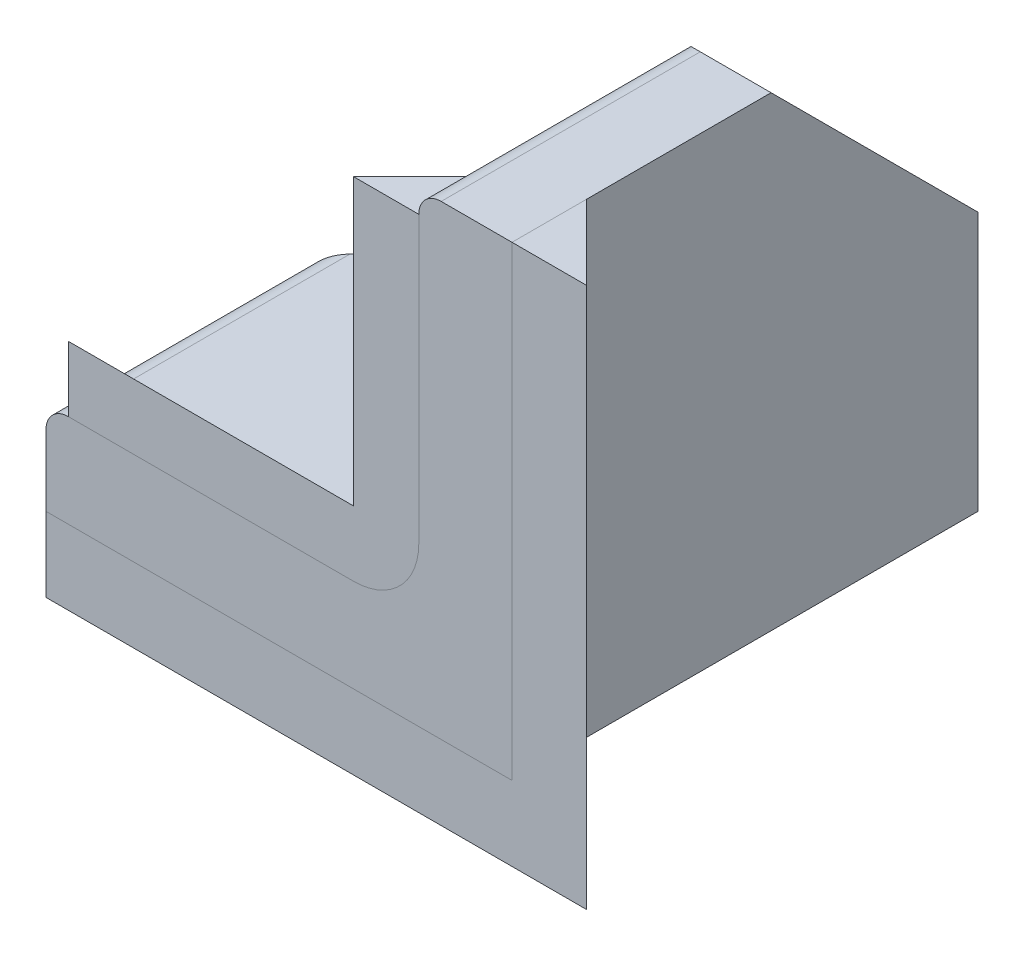
ISO-10303-21;
HEADER;
FILE_DESCRIPTION(('STEP AP214'),'2;1');
FILE_NAME('part.step','',(''),(''),'','','');
FILE_SCHEMA(('AUTOMOTIVE_DESIGN { 1 0 10303 214 1 1 1 1 }'));
ENDSEC;
DATA;
#1=APPLICATION_CONTEXT('core data for automotive mechanical design processes');
#2=APPLICATION_PROTOCOL_DEFINITION('international standard','automotive_design',2000,#1);
#3=PRODUCT_CONTEXT('',#1,'mechanical');
#4=PRODUCT('Part','Part','',(#3));
#5=PRODUCT_RELATED_PRODUCT_CATEGORY('part','',(#4));
#6=PRODUCT_DEFINITION_FORMATION('','',#4);
#7=PRODUCT_DEFINITION_CONTEXT('part definition',#1,'design');
#8=PRODUCT_DEFINITION('design','',#6,#7);
#9=PRODUCT_DEFINITION_SHAPE('','',#8);
#10=(LENGTH_UNIT() NAMED_UNIT(*) SI_UNIT(.MILLI.,.METRE.));
#11=(NAMED_UNIT(*) PLANE_ANGLE_UNIT() SI_UNIT($,.RADIAN.));
#12=(NAMED_UNIT(*) SI_UNIT($,.STERADIAN.) SOLID_ANGLE_UNIT());
#13=UNCERTAINTY_MEASURE_WITH_UNIT(LENGTH_MEASURE(1.E-05),#10,'distance_accuracy_value','');
#14=(GEOMETRIC_REPRESENTATION_CONTEXT(3) GLOBAL_UNCERTAINTY_ASSIGNED_CONTEXT((#13)) GLOBAL_UNIT_ASSIGNED_CONTEXT((#10,
#11,#12)) REPRESENTATION_CONTEXT('',''));
#15=CARTESIAN_POINT('',(0.,0.,0.));
#16=DIRECTION('',(0.,0.,1.));
#17=DIRECTION('',(1.,0.,0.));
#18=AXIS2_PLACEMENT_3D('',#15,#16,#17);
#19=CARTESIAN_POINT('',(0.,0.,-4.));
#20=DIRECTION('',(0.,-1.,0.));
#21=DIRECTION('',(1.,0.,0.));
#22=AXIS2_PLACEMENT_3D('',#19,#20,#21);
#23=PLANE('',#22);
#24=DIRECTION('',(0.,0.,-1.));
#25=VECTOR('',#24,1.);
#26=CARTESIAN_POINT('',(-25.,0.,-4.));
#27=LINE('',#26,#25);
#28=CARTESIAN_POINT('',(-25.,0.,0.));
#29=VERTEX_POINT('',#28);
#30=CARTESIAN_POINT('',(-25.,0.,-4.));
#31=VERTEX_POINT('',#30);
#32=EDGE_CURVE('E56',#29,#31,#27,.T.);
#33=ORIENTED_EDGE('',*,*,#32,.F.);
#34=DIRECTION('',(-1.,0.,0.));
#35=VECTOR('',#34,1.);
#36=CARTESIAN_POINT('',(0.,0.,0.));
#37=LINE('',#36,#35);
#38=CARTESIAN_POINT('',(0.,0.,0.));
#39=VERTEX_POINT('',#38);
#40=EDGE_CURVE('E121',#39,#29,#37,.T.);
#41=ORIENTED_EDGE('',*,*,#40,.F.);
#42=DIRECTION('',(0.,0.,1.));
#43=VECTOR('',#42,1.);
#44=CARTESIAN_POINT('',(0.,0.,-4.));
#45=LINE('',#44,#43);
#46=CARTESIAN_POINT('',(0.,0.,-4.));
#47=VERTEX_POINT('',#46);
#48=EDGE_CURVE('E113',#47,#39,#45,.T.);
#49=ORIENTED_EDGE('',*,*,#48,.F.);
#50=DIRECTION('',(-1.,0.,0.));
#51=VECTOR('',#50,1.);
#52=CARTESIAN_POINT('',(0.,0.,-4.));
#53=LINE('',#52,#51);
#54=EDGE_CURVE('E126',#47,#31,#53,.T.);
#55=ORIENTED_EDGE('',*,*,#54,.T.);
#56=EDGE_LOOP('',(#33,#41,#49,#55));
#57=FACE_BOUND('',#56,.T.);
#58=ADVANCED_FACE('F48',(#57),#23,.F.);
#59=CARTESIAN_POINT('',(5.21895141649746,-5.21895141649746,1.21895141649746));
#60=DIRECTION('',(0.,0.707106781186547,0.707106781186547));
#61=DIRECTION('',(0.,-0.707106781186548,0.707106781186548));
#62=AXIS2_PLACEMENT_3D('',#59,#60,#61);
#63=PLANE('',#62);
#64=DIRECTION('',(0.,-0.707106781186548,0.707106781186548));
#65=VECTOR('',#64,1.);
#66=CARTESIAN_POINT('',(-25.,-5.21895141649746,1.21895141649746));
#67=LINE('',#66,#65);
#68=CARTESIAN_POINT('',(-25.,-4.,0.));
#69=VERTEX_POINT('',#68);
#70=EDGE_CURVE('E13',#31,#69,#67,.T.);
#71=ORIENTED_EDGE('',*,*,#70,.F.);
#72=ORIENTED_EDGE('',*,*,#54,.F.);
#73=DIRECTION('',(-0.577350269189626,0.577350269189626,-0.577350269189626));
#74=VECTOR('',#73,1.);
#75=CARTESIAN_POINT('',(5.21895141649746,-5.21895141649746,1.21895141649746));
#76=LINE('',#75,#74);
#77=CARTESIAN_POINT('',(4.,-4.,0.));
#78=VERTEX_POINT('',#77);
#79=EDGE_CURVE('E97',#78,#47,#76,.T.);
#80=ORIENTED_EDGE('',*,*,#79,.F.);
#81=DIRECTION('',(-1.,0.,0.));
#82=VECTOR('',#81,1.);
#83=CARTESIAN_POINT('',(4.,-4.,0.));
#84=LINE('',#83,#82);
#85=EDGE_CURVE('E124',#78,#69,#84,.T.);
#86=ORIENTED_EDGE('',*,*,#85,.T.);
#87=EDGE_LOOP('',(#71,#72,#80,#86));
#88=FACE_BOUND('',#87,.T.);
#89=ADVANCED_FACE('F50',(#88),#63,.F.);
#90=CARTESIAN_POINT('',(0.,25.,-4.));
#91=DIRECTION('',(0.,1.,0.));
#92=DIRECTION('',(0.,0.,1.));
#93=AXIS2_PLACEMENT_3D('',#90,#91,#92);
#94=PLANE('',#93);
#95=DIRECTION('',(-0.707106781186548,0.,-0.707106781186548));
#96=VECTOR('',#95,1.);
#97=CARTESIAN_POINT('',(4.,25.,0.));
#98=LINE('',#97,#96);
#99=CARTESIAN_POINT('',(4.,25.,0.));
#100=VERTEX_POINT('',#99);
#101=CARTESIAN_POINT('',(0.,25.,-4.));
#102=VERTEX_POINT('',#101);
#103=EDGE_CURVE('E94',#100,#102,#98,.T.);
#104=ORIENTED_EDGE('',*,*,#103,.T.);
#105=DIRECTION('',(0.,0.,1.));
#106=VECTOR('',#105,1.);
#107=CARTESIAN_POINT('',(0.,25.,-4.));
#108=LINE('',#107,#106);
#109=CARTESIAN_POINT('',(0.,25.,0.));
#110=VERTEX_POINT('',#109);
#111=EDGE_CURVE('E104',#102,#110,#108,.T.);
#112=ORIENTED_EDGE('',*,*,#111,.T.);
#113=DIRECTION('',(1.,0.,0.));
#114=VECTOR('',#113,1.);
#115=CARTESIAN_POINT('',(0.,25.,0.));
#116=LINE('',#115,#114);
#117=EDGE_CURVE('E101',#110,#100,#116,.T.);
#118=ORIENTED_EDGE('',*,*,#117,.T.);
#119=EDGE_LOOP('',(#104,#112,#118));
#120=FACE_BOUND('',#119,.T.);
#121=ADVANCED_FACE('F110',(#120),#94,.T.);
#122=CARTESIAN_POINT('',(4.,-7.65685424949238,0.));
#123=DIRECTION('',(0.707106781186547,0.,-0.707106781186547));
#124=DIRECTION('',(-0.707106781186548,0.,-0.707106781186548));
#125=AXIS2_PLACEMENT_3D('',#122,#123,#124);
#126=PLANE('',#125);
#127=DIRECTION('',(0.,1.,0.));
#128=VECTOR('',#127,1.);
#129=CARTESIAN_POINT('',(4.,-7.65685424949238,0.));
#130=LINE('',#129,#128);
#131=EDGE_CURVE('E117',#78,#100,#130,.T.);
#132=ORIENTED_EDGE('',*,*,#131,.F.);
#133=ORIENTED_EDGE('',*,*,#79,.T.);
#134=DIRECTION('',(0.,1.,0.));
#135=VECTOR('',#134,1.);
#136=CARTESIAN_POINT('',(0.,-7.65685424949238,-4.));
#137=LINE('',#136,#135);
#138=EDGE_CURVE('E89',#47,#102,#137,.T.);
#139=ORIENTED_EDGE('',*,*,#138,.T.);
#140=ORIENTED_EDGE('',*,*,#103,.F.);
#141=EDGE_LOOP('',(#132,#133,#139,#140));
#142=FACE_BOUND('',#141,.T.);
#143=ADVANCED_FACE('F92',(#142),#126,.T.);
#144=CARTESIAN_POINT('',(0.,-7.65685424949238,-4.));
#145=DIRECTION('',(-1.,0.,0.));
#146=DIRECTION('',(0.,0.,1.));
#147=AXIS2_PLACEMENT_3D('',#144,#145,#146);
#148=PLANE('',#147);
#149=ORIENTED_EDGE('',*,*,#138,.F.);
#150=ORIENTED_EDGE('',*,*,#48,.T.);
#151=DIRECTION('',(0.,1.,0.));
#152=VECTOR('',#151,1.);
#153=CARTESIAN_POINT('',(0.,-7.65685424949238,0.));
#154=LINE('',#153,#152);
#155=EDGE_CURVE('E100',#39,#110,#154,.T.);
#156=ORIENTED_EDGE('',*,*,#155,.T.);
#157=ORIENTED_EDGE('',*,*,#111,.F.);
#158=EDGE_LOOP('',(#149,#150,#156,#157));
#159=FACE_BOUND('',#158,.T.);
#160=ADVANCED_FACE('F105',(#159),#148,.T.);
#161=CARTESIAN_POINT('',(0.,-7.65685424949238,0.));
#162=DIRECTION('',(0.,0.,1.));
#163=DIRECTION('',(1.,0.,0.));
#164=AXIS2_PLACEMENT_3D('',#161,#162,#163);
#165=PLANE('',#164);
#166=ORIENTED_EDGE('',*,*,#155,.F.);
#167=ORIENTED_EDGE('',*,*,#40,.T.);
#168=DIRECTION('',(0.,1.,0.));
#169=VECTOR('',#168,1.);
#170=CARTESIAN_POINT('',(-25.,-3.82842712474619,0.));
#171=LINE('',#170,#169);
#172=EDGE_CURVE('E64',#69,#29,#171,.T.);
#173=ORIENTED_EDGE('',*,*,#172,.F.);
#174=ORIENTED_EDGE('',*,*,#85,.F.);
#175=ORIENTED_EDGE('',*,*,#131,.T.);
#176=ORIENTED_EDGE('',*,*,#117,.F.);
#177=EDGE_LOOP('',(#166,#167,#173,#174,#175,#176));
#178=FACE_BOUND('',#177,.T.);
#179=ADVANCED_FACE('F133',(#178),#165,.T.);
#180=CARTESIAN_POINT('',(-25.,-2.,-2.));
#181=DIRECTION('',(-1.,0.,0.));
#182=DIRECTION('',(0.,-1.,0.));
#183=AXIS2_PLACEMENT_3D('',#180,#181,#182);
#184=PLANE('',#183);
#185=ORIENTED_EDGE('',*,*,#32,.T.);
#186=ORIENTED_EDGE('',*,*,#70,.T.);
#187=ORIENTED_EDGE('',*,*,#172,.T.);
#188=EDGE_LOOP('',(#185,#186,#187));
#189=FACE_BOUND('',#188,.T.);
#190=ADVANCED_FACE('F131',(#189),#184,.T.);
#191=CLOSED_SHELL('',(#58,#89,#121,#143,#160,#179,#190));
#192=MANIFOLD_SOLID_BREP('B2',#191);
#193=CARTESIAN_POINT('',(-8.5,5.,-3.5));
#194=DIRECTION('',(0.,-0.707106781186548,0.707106781186548));
#195=DIRECTION('',(0.,-0.707106781186548,-0.707106781186548));
#196=AXIS2_PLACEMENT_3D('',#193,#194,#195);
#197=PLANE('',#196);
#198=DIRECTION('',(0.,0.707106781186547,0.707106781186547));
#199=VECTOR('',#198,1.);
#200=CARTESIAN_POINT('',(-8.5,5.,-3.5));
#201=LINE('',#200,#199);
#202=CARTESIAN_POINT('',(-8.5,5.,-3.5));
#203=VERTEX_POINT('',#202);
#204=CARTESIAN_POINT('',(-8.5,8.5,0.));
#205=VERTEX_POINT('',#204);
#206=EDGE_CURVE('E264',#203,#205,#201,.T.);
#207=ORIENTED_EDGE('',*,*,#206,.F.);
#208=DIRECTION('',(-1.,0.,0.));
#209=VECTOR('',#208,1.);
#210=CARTESIAN_POINT('',(-8.5,5.,-3.5));
#211=LINE('',#210,#209);
#212=CARTESIAN_POINT('',(-23.8,5.,-3.5));
#213=VERTEX_POINT('',#212);
#214=EDGE_CURVE('E210',#203,#213,#211,.T.);
#215=ORIENTED_EDGE('',*,*,#214,.T.);
#216=DIRECTION('',(0.,0.707106781186547,0.707106781186547));
#217=VECTOR('',#216,1.);
#218=CARTESIAN_POINT('',(-23.8,5.,-3.5));
#219=LINE('',#218,#217);
#220=CARTESIAN_POINT('',(-23.8,8.5,0.));
#221=VERTEX_POINT('',#220);
#222=EDGE_CURVE('E217',#213,#221,#219,.T.);
#223=ORIENTED_EDGE('',*,*,#222,.T.);
#224=DIRECTION('',(-1.,0.,0.));
#225=VECTOR('',#224,1.);
#226=CARTESIAN_POINT('',(-8.5,8.5,0.));
#227=LINE('',#226,#225);
#228=EDGE_CURVE('E46',#205,#221,#227,.T.);
#229=ORIENTED_EDGE('',*,*,#228,.F.);
#230=EDGE_LOOP('',(#207,#215,#223,#229));
#231=FACE_BOUND('',#230,.T.);
#232=ADVANCED_FACE('F203',(#231),#197,.F.);
#233=CARTESIAN_POINT('',(-8.5,5.,0.));
#234=DIRECTION('',(0.,1.,0.));
#235=DIRECTION('',(-1.,0.,0.));
#236=AXIS2_PLACEMENT_3D('',#233,#234,#235);
#237=PLANE('',#236);
#238=DIRECTION('',(0.,0.,-1.));
#239=VECTOR('',#238,1.);
#240=CARTESIAN_POINT('',(-8.5,5.,0.));
#241=LINE('',#240,#239);
#242=CARTESIAN_POINT('',(-8.5,5.,0.));
#243=VERTEX_POINT('',#242);
#244=EDGE_CURVE('E287',#243,#203,#241,.T.);
#245=ORIENTED_EDGE('',*,*,#244,.F.);
#246=DIRECTION('',(-1.,0.,0.));
#247=VECTOR('',#246,1.);
#248=CARTESIAN_POINT('',(-8.5,5.,0.));
#249=LINE('',#248,#247);
#250=CARTESIAN_POINT('',(-23.8,5.,0.));
#251=VERTEX_POINT('',#250);
#252=EDGE_CURVE('E259',#243,#251,#249,.T.);
#253=ORIENTED_EDGE('',*,*,#252,.T.);
#254=DIRECTION('',(0.,0.,-1.));
#255=VECTOR('',#254,1.);
#256=CARTESIAN_POINT('',(-23.8,5.,0.));
#257=LINE('',#256,#255);
#258=EDGE_CURVE('E225',#251,#213,#257,.T.);
#259=ORIENTED_EDGE('',*,*,#258,.T.);
#260=ORIENTED_EDGE('',*,*,#214,.F.);
#261=EDGE_LOOP('',(#245,#253,#259,#260));
#262=FACE_BOUND('',#261,.T.);
#263=ADVANCED_FACE('F297',(#262),#237,.F.);
#264=CARTESIAN_POINT('',(-8.5,8.5,-3.5));
#265=DIRECTION('',(0.,0.,-1.));
#266=DIRECTION('',(-1.,0.,0.));
#267=AXIS2_PLACEMENT_3D('',#264,#265,#266);
#268=CONICAL_SURFACE('',#267,3.5,0.785398163397448);
#269=DIRECTION('',(-0.707106781186547,0.,0.707106781186547));
#270=VECTOR('',#269,1.);
#271=CARTESIAN_POINT('',(-5.,8.5,-3.5));
#272=LINE('',#271,#270);
#273=CARTESIAN_POINT('',(-5.,8.5,-3.5));
#274=VERTEX_POINT('',#273);
#275=EDGE_CURVE('E272',#274,#205,#272,.T.);
#276=ORIENTED_EDGE('',*,*,#275,.F.);
#277=CARTESIAN_POINT('',(-8.5,8.5,-3.5));
#278=DIRECTION('',(0.,0.,-1.));
#279=DIRECTION('',(-1.,0.,0.));
#280=AXIS2_PLACEMENT_3D('',#277,#278,#279);
#281=CIRCLE('',#280,3.5);
#282=EDGE_CURVE('E263',#274,#203,#281,.T.);
#283=ORIENTED_EDGE('',*,*,#282,.T.);
#284=ORIENTED_EDGE('',*,*,#206,.T.);
#285=EDGE_LOOP('',(#276,#283,#284));
#286=FACE_BOUND('',#285,.T.);
#287=ADVANCED_FACE('F299',(#286),#268,.F.);
#288=CARTESIAN_POINT('',(-8.5,8.5,0.));
#289=DIRECTION('',(0.,0.,-1.));
#290=DIRECTION('',(-1.,0.,0.));
#291=AXIS2_PLACEMENT_3D('',#288,#289,#290);
#292=CYLINDRICAL_SURFACE('',#291,3.5);
#293=DIRECTION('',(0.,0.,-1.));
#294=VECTOR('',#293,1.);
#295=CARTESIAN_POINT('',(-5.,8.5,0.));
#296=LINE('',#295,#294);
#297=CARTESIAN_POINT('',(-5.,8.5,0.));
#298=VERTEX_POINT('',#297);
#299=EDGE_CURVE('E267',#298,#274,#296,.T.);
#300=ORIENTED_EDGE('',*,*,#299,.F.);
#301=CARTESIAN_POINT('',(-8.5,8.5,0.));
#302=DIRECTION('',(0.,0.,-1.));
#303=DIRECTION('',(-1.,0.,0.));
#304=AXIS2_PLACEMENT_3D('',#301,#302,#303);
#305=CIRCLE('',#304,3.5);
#306=EDGE_CURVE('E252',#298,#243,#305,.T.);
#307=ORIENTED_EDGE('',*,*,#306,.T.);
#308=ORIENTED_EDGE('',*,*,#244,.T.);
#309=ORIENTED_EDGE('',*,*,#282,.F.);
#310=EDGE_LOOP('',(#300,#307,#308,#309));
#311=FACE_BOUND('',#310,.T.);
#312=ADVANCED_FACE('F268',(#311),#292,.T.);
#313=CARTESIAN_POINT('',(-8.5,8.5,0.));
#314=DIRECTION('',(0.,0.,1.));
#315=DIRECTION('',(1.,0.,0.));
#316=AXIS2_PLACEMENT_3D('',#313,#314,#315);
#317=PLANE('',#316);
#318=DIRECTION('',(1.,0.,0.));
#319=VECTOR('',#318,1.);
#320=CARTESIAN_POINT('',(-8.5,23.8,0.));
#321=LINE('',#320,#319);
#322=CARTESIAN_POINT('',(-8.5,23.8,0.));
#323=VERTEX_POINT('',#322);
#324=CARTESIAN_POINT('',(-5.,23.8,0.));
#325=VERTEX_POINT('',#324);
#326=EDGE_CURVE('E308',#323,#325,#321,.T.);
#327=ORIENTED_EDGE('',*,*,#326,.F.);
#328=DIRECTION('',(0.,1.,0.));
#329=VECTOR('',#328,1.);
#330=CARTESIAN_POINT('',(-8.5,8.5,0.));
#331=LINE('',#330,#329);
#332=EDGE_CURVE('E281',#205,#323,#331,.T.);
#333=ORIENTED_EDGE('',*,*,#332,.F.);
#334=ORIENTED_EDGE('',*,*,#228,.T.);
#335=DIRECTION('',(0.,-1.,0.));
#336=VECTOR('',#335,1.);
#337=CARTESIAN_POINT('',(-23.8,8.5,0.));
#338=LINE('',#337,#336);
#339=EDGE_CURVE('E292',#221,#251,#338,.T.);
#340=ORIENTED_EDGE('',*,*,#339,.T.);
#341=ORIENTED_EDGE('',*,*,#252,.F.);
#342=ORIENTED_EDGE('',*,*,#306,.F.);
#343=DIRECTION('',(0.,1.,0.));
#344=VECTOR('',#343,1.);
#345=CARTESIAN_POINT('',(-5.,8.5,0.));
#346=LINE('',#345,#344);
#347=EDGE_CURVE('E257',#298,#325,#346,.T.);
#348=ORIENTED_EDGE('',*,*,#347,.T.);
#349=EDGE_LOOP('',(#327,#333,#334,#340,#341,#342,#348));
#350=FACE_BOUND('',#349,.T.);
#351=ADVANCED_FACE('F255',(#350),#317,.T.);
#352=CARTESIAN_POINT('',(-5.,8.5,-3.5));
#353=DIRECTION('',(-0.707106781186548,0.,-0.707106781186548));
#354=DIRECTION('',(-0.707106781186548,0.,0.707106781186548));
#355=AXIS2_PLACEMENT_3D('',#352,#353,#354);
#356=PLANE('',#355);
#357=DIRECTION('',(-0.707106781186547,0.,0.707106781186547));
#358=VECTOR('',#357,1.);
#359=CARTESIAN_POINT('',(-5.,23.8,-3.5));
#360=LINE('',#359,#358);
#361=CARTESIAN_POINT('',(-5.,23.8,-3.5));
#362=VERTEX_POINT('',#361);
#363=EDGE_CURVE('E273',#362,#323,#360,.T.);
#364=ORIENTED_EDGE('',*,*,#363,.F.);
#365=DIRECTION('',(0.,1.,0.));
#366=VECTOR('',#365,1.);
#367=CARTESIAN_POINT('',(-5.,8.5,-3.5));
#368=LINE('',#367,#366);
#369=EDGE_CURVE('E279',#274,#362,#368,.T.);
#370=ORIENTED_EDGE('',*,*,#369,.F.);
#371=ORIENTED_EDGE('',*,*,#275,.T.);
#372=ORIENTED_EDGE('',*,*,#332,.T.);
#373=EDGE_LOOP('',(#364,#370,#371,#372));
#374=FACE_BOUND('',#373,.T.);
#375=ADVANCED_FACE('F304',(#374),#356,.T.);
#376=CARTESIAN_POINT('',(-5.,8.5,0.));
#377=DIRECTION('',(1.,0.,0.));
#378=DIRECTION('',(0.,1.,0.));
#379=AXIS2_PLACEMENT_3D('',#376,#377,#378);
#380=PLANE('',#379);
#381=DIRECTION('',(0.,0.,-1.));
#382=VECTOR('',#381,1.);
#383=CARTESIAN_POINT('',(-5.,23.8,0.));
#384=LINE('',#383,#382);
#385=EDGE_CURVE('E277',#325,#362,#384,.T.);
#386=ORIENTED_EDGE('',*,*,#385,.F.);
#387=ORIENTED_EDGE('',*,*,#347,.F.);
#388=ORIENTED_EDGE('',*,*,#299,.T.);
#389=ORIENTED_EDGE('',*,*,#369,.T.);
#390=EDGE_LOOP('',(#386,#387,#388,#389));
#391=FACE_BOUND('',#390,.T.);
#392=ADVANCED_FACE('F275',(#391),#380,.T.);
#393=CARTESIAN_POINT('',(-23.8,5.,0.));
#394=DIRECTION('',(1.,0.,0.));
#395=DIRECTION('',(0.,0.,1.));
#396=AXIS2_PLACEMENT_3D('',#393,#394,#395);
#397=PLANE('',#396);
#398=ORIENTED_EDGE('',*,*,#339,.F.);
#399=ORIENTED_EDGE('',*,*,#222,.F.);
#400=ORIENTED_EDGE('',*,*,#258,.F.);
#401=EDGE_LOOP('',(#398,#399,#400));
#402=FACE_BOUND('',#401,.T.);
#403=ADVANCED_FACE('F313',(#402),#397,.F.);
#404=CARTESIAN_POINT('',(-5.,23.8,0.));
#405=DIRECTION('',(0.,1.,0.));
#406=DIRECTION('',(0.,0.,1.));
#407=AXIS2_PLACEMENT_3D('',#404,#405,#406);
#408=PLANE('',#407);
#409=ORIENTED_EDGE('',*,*,#326,.T.);
#410=ORIENTED_EDGE('',*,*,#385,.T.);
#411=ORIENTED_EDGE('',*,*,#363,.T.);
#412=EDGE_LOOP('',(#409,#410,#411));
#413=FACE_BOUND('',#412,.T.);
#414=ADVANCED_FACE('F307',(#413),#408,.T.);
#415=CLOSED_SHELL('',(#232,#263,#287,#312,#351,#375,#392,#403,#414));
#416=MANIFOLD_SOLID_BREP('B7',#415);
#417=CARTESIAN_POINT('',(-25.,0.,-25.));
#418=DIRECTION('',(0.,1.,0.));
#419=DIRECTION('',(-1.,0.,0.));
#420=AXIS2_PLACEMENT_3D('',#417,#418,#419);
#421=PLANE('',#420);
#422=DIRECTION('',(0.,0.,1.));
#423=VECTOR('',#422,1.);
#424=CARTESIAN_POINT('',(-25.,0.,-25.));
#425=LINE('',#424,#423);
#426=CARTESIAN_POINT('',(-25.,0.,-13.9));
#427=VERTEX_POINT('',#426);
#428=CARTESIAN_POINT('',(-25.,0.,0.));
#429=VERTEX_POINT('',#428);
#430=EDGE_CURVE('E543',#427,#429,#425,.T.);
#431=ORIENTED_EDGE('',*,*,#430,.F.);
#432=DIRECTION('',(0.707106781186546,0.,-0.707106781186549));
#433=VECTOR('',#432,1.);
#434=CARTESIAN_POINT('',(-13.9,0.,-25.));
#435=LINE('',#434,#433);
#436=CARTESIAN_POINT('',(-13.9,0.,-25.));
#437=VERTEX_POINT('',#436);
#438=EDGE_CURVE('E201',#427,#437,#435,.T.);
#439=ORIENTED_EDGE('',*,*,#438,.T.);
#440=DIRECTION('',(-1.,0.,0.));
#441=VECTOR('',#440,1.);
#442=CARTESIAN_POINT('',(-25.,0.,-25.));
#443=LINE('',#442,#441);
#444=CARTESIAN_POINT('',(0.,0.,-25.));
#445=VERTEX_POINT('',#444);
#446=EDGE_CURVE('E485',#445,#437,#443,.T.);
#447=ORIENTED_EDGE('',*,*,#446,.F.);
#448=DIRECTION('',(0.,0.,1.));
#449=VECTOR('',#448,1.);
#450=CARTESIAN_POINT('',(0.,0.,-25.));
#451=LINE('',#450,#449);
#452=CARTESIAN_POINT('',(0.,0.,0.));
#453=VERTEX_POINT('',#452);
#454=EDGE_CURVE('E507',#445,#453,#451,.T.);
#455=ORIENTED_EDGE('',*,*,#454,.T.);
#456=DIRECTION('',(-1.,0.,0.));
#457=VECTOR('',#456,1.);
#458=CARTESIAN_POINT('',(-25.,0.,0.));
#459=LINE('',#458,#457);
#460=EDGE_CURVE('E508',#453,#429,#459,.T.);
#461=ORIENTED_EDGE('',*,*,#460,.T.);
#462=EDGE_LOOP('',(#431,#439,#447,#455,#461));
#463=FACE_BOUND('',#462,.T.);
#464=ADVANCED_FACE('F392',(#463),#421,.F.);
#465=CARTESIAN_POINT('',(-25.,0.,-25.));
#466=DIRECTION('',(1.,0.,0.));
#467=DIRECTION('',(0.,0.,-1.));
#468=AXIS2_PLACEMENT_3D('',#465,#466,#467);
#469=PLANE('',#468);
#470=DIRECTION('',(0.,0.,1.));
#471=VECTOR('',#470,1.);
#472=CARTESIAN_POINT('',(-25.,3.8,-25.));
#473=LINE('',#472,#471);
#474=CARTESIAN_POINT('',(-25.,3.8,-13.9));
#475=VERTEX_POINT('',#474);
#476=CARTESIAN_POINT('',(-25.,3.8,0.));
#477=VERTEX_POINT('',#476);
#478=EDGE_CURVE('E541',#475,#477,#473,.T.);
#479=ORIENTED_EDGE('',*,*,#478,.F.);
#480=DIRECTION('',(0.,-1.,0.));
#481=VECTOR('',#480,1.);
#482=CARTESIAN_POINT('',(-25.,0.,-13.9));
#483=LINE('',#482,#481);
#484=EDGE_CURVE('E400',#475,#427,#483,.T.);
#485=ORIENTED_EDGE('',*,*,#484,.T.);
#486=ORIENTED_EDGE('',*,*,#430,.T.);
#487=DIRECTION('',(0.,1.,0.));
#488=VECTOR('',#487,1.);
#489=CARTESIAN_POINT('',(-25.,0.,0.));
#490=LINE('',#489,#488);
#491=EDGE_CURVE('E511',#429,#477,#490,.T.);
#492=ORIENTED_EDGE('',*,*,#491,.T.);
#493=EDGE_LOOP('',(#479,#485,#486,#492));
#494=FACE_BOUND('',#493,.T.);
#495=ADVANCED_FACE('F576',(#494),#469,.F.);
#496=CARTESIAN_POINT('',(-23.8,3.8,-25.));
#497=DIRECTION('',(0.,0.,1.));
#498=DIRECTION('',(1.,0.,0.));
#499=AXIS2_PLACEMENT_3D('',#496,#497,#498);
#500=CYLINDRICAL_SURFACE('',#499,1.2);
#501=DIRECTION('',(0.,0.,1.));
#502=VECTOR('',#501,1.);
#503=CARTESIAN_POINT('',(-23.8,5.,-25.));
#504=LINE('',#503,#502);
#505=CARTESIAN_POINT('',(-23.8,5.,-15.1));
#506=VERTEX_POINT('',#505);
#507=CARTESIAN_POINT('',(-23.8,5.,0.));
#508=VERTEX_POINT('',#507);
#509=EDGE_CURVE('E494',#506,#508,#504,.T.);
#510=ORIENTED_EDGE('',*,*,#509,.F.);
#511=CARTESIAN_POINT('',(-23.8,3.8,-15.1));
#512=DIRECTION('',(-0.707106781186549,0.,-0.707106781186546));
#513=DIRECTION('',(-0.707106781186546,0.,0.707106781186549));
#514=AXIS2_PLACEMENT_3D('',#511,#512,#513);
#515=ELLIPSE('',#514,1.69705627484772,1.2);
#516=EDGE_CURVE('E414',#506,#475,#515,.F.);
#517=ORIENTED_EDGE('',*,*,#516,.T.);
#518=ORIENTED_EDGE('',*,*,#478,.T.);
#519=CARTESIAN_POINT('',(-23.8,3.8,0.));
#520=DIRECTION('',(0.,0.,-1.));
#521=DIRECTION('',(1.,0.,0.));
#522=AXIS2_PLACEMENT_3D('',#519,#520,#521);
#523=CIRCLE('',#522,1.2);
#524=EDGE_CURVE('E514',#477,#508,#523,.T.);
#525=ORIENTED_EDGE('',*,*,#524,.T.);
#526=EDGE_LOOP('',(#510,#517,#518,#525));
#527=FACE_BOUND('',#526,.T.);
#528=ADVANCED_FACE('F560',(#527),#500,.T.);
#529=CARTESIAN_POINT('',(-8.5,5.,-25.));
#530=DIRECTION('',(0.,-1.,0.));
#531=DIRECTION('',(0.,0.,-1.));
#532=AXIS2_PLACEMENT_3D('',#529,#530,#531);
#533=PLANE('',#532);
#534=DIRECTION('',(1.,0.,0.));
#535=VECTOR('',#534,1.);
#536=CARTESIAN_POINT('',(-8.5,5.,-25.));
#537=LINE('',#536,#535);
#538=CARTESIAN_POINT('',(-13.9,5.,-25.));
#539=VERTEX_POINT('',#538);
#540=CARTESIAN_POINT('',(-8.5,5.,-25.));
#541=VERTEX_POINT('',#540);
#542=EDGE_CURVE('E474',#539,#541,#537,.T.);
#543=ORIENTED_EDGE('',*,*,#542,.F.);
#544=DIRECTION('',(-0.707106781186546,0.,0.707106781186549));
#545=VECTOR('',#544,1.);
#546=CARTESIAN_POINT('',(-13.9,5.,-25.));
#547=LINE('',#546,#545);
#548=EDGE_CURVE('E557',#539,#506,#547,.T.);
#549=ORIENTED_EDGE('',*,*,#548,.T.);
#550=ORIENTED_EDGE('',*,*,#509,.T.);
#551=DIRECTION('',(1.,0.,0.));
#552=VECTOR('',#551,1.);
#553=CARTESIAN_POINT('',(-8.5,5.,0.));
#554=LINE('',#553,#552);
#555=CARTESIAN_POINT('',(-8.5,5.,0.));
#556=VERTEX_POINT('',#555);
#557=EDGE_CURVE('E491',#508,#556,#554,.T.);
#558=ORIENTED_EDGE('',*,*,#557,.T.);
#559=DIRECTION('',(0.,0.,1.));
#560=VECTOR('',#559,1.);
#561=CARTESIAN_POINT('',(-8.5,5.,-25.));
#562=LINE('',#561,#560);
#563=EDGE_CURVE('E488',#541,#556,#562,.T.);
#564=ORIENTED_EDGE('',*,*,#563,.F.);
#565=EDGE_LOOP('',(#543,#549,#550,#558,#564));
#566=FACE_BOUND('',#565,.T.);
#567=ADVANCED_FACE('F489',(#566),#533,.F.);
#568=CARTESIAN_POINT('',(-8.5,8.5,-25.));
#569=DIRECTION('',(0.,0.,1.));
#570=DIRECTION('',(1.,0.,0.));
#571=AXIS2_PLACEMENT_3D('',#568,#569,#570);
#572=CYLINDRICAL_SURFACE('',#571,3.5);
#573=CARTESIAN_POINT('',(-8.5,8.5,0.));
#574=DIRECTION('',(0.,0.,1.));
#575=DIRECTION('',(1.,0.,0.));
#576=AXIS2_PLACEMENT_3D('',#573,#574,#575);
#577=CIRCLE('',#576,3.5);
#578=CARTESIAN_POINT('',(-5.,8.5,0.));
#579=VERTEX_POINT('',#578);
#580=EDGE_CURVE('E518',#556,#579,#577,.T.);
#581=ORIENTED_EDGE('',*,*,#580,.T.);
#582=DIRECTION('',(0.,0.,1.));
#583=VECTOR('',#582,1.);
#584=CARTESIAN_POINT('',(-5.,8.5,-25.));
#585=LINE('',#584,#583);
#586=CARTESIAN_POINT('',(-5.,8.5,-25.));
#587=VERTEX_POINT('',#586);
#588=EDGE_CURVE('E495',#587,#579,#585,.T.);
#589=ORIENTED_EDGE('',*,*,#588,.F.);
#590=CARTESIAN_POINT('',(-8.5,8.5,-25.));
#591=DIRECTION('',(0.,0.,1.));
#592=DIRECTION('',(1.,0.,0.));
#593=AXIS2_PLACEMENT_3D('',#590,#591,#592);
#594=CIRCLE('',#593,3.5);
#595=EDGE_CURVE('E479',#541,#587,#594,.T.);
#596=ORIENTED_EDGE('',*,*,#595,.F.);
#597=ORIENTED_EDGE('',*,*,#563,.T.);
#598=EDGE_LOOP('',(#581,#589,#596,#597));
#599=FACE_BOUND('',#598,.T.);
#600=ADVANCED_FACE('F497',(#599),#572,.F.);
#601=CARTESIAN_POINT('',(-5.,23.8,-25.));
#602=DIRECTION('',(1.,0.,0.));
#603=DIRECTION('',(0.,1.,0.));
#604=AXIS2_PLACEMENT_3D('',#601,#602,#603);
#605=PLANE('',#604);
#606=DIRECTION('',(0.,0.,1.));
#607=VECTOR('',#606,1.);
#608=CARTESIAN_POINT('',(-5.,23.8,-25.));
#609=LINE('',#608,#607);
#610=CARTESIAN_POINT('',(-5.,23.8,-15.1));
#611=VERTEX_POINT('',#610);
#612=CARTESIAN_POINT('',(-5.,23.8,0.));
#613=VERTEX_POINT('',#612);
#614=EDGE_CURVE('E537',#611,#613,#609,.T.);
#615=ORIENTED_EDGE('',*,*,#614,.F.);
#616=DIRECTION('',(0.,-0.707106781186546,-0.707106781186549));
#617=VECTOR('',#616,1.);
#618=CARTESIAN_POINT('',(-5.,13.9,-25.));
#619=LINE('',#618,#617);
#620=CARTESIAN_POINT('',(-5.,13.9,-25.));
#621=VERTEX_POINT('',#620);
#622=EDGE_CURVE('E555',#611,#621,#619,.T.);
#623=ORIENTED_EDGE('',*,*,#622,.T.);
#624=DIRECTION('',(0.,1.,0.));
#625=VECTOR('',#624,1.);
#626=CARTESIAN_POINT('',(-5.,23.8,-25.));
#627=LINE('',#626,#625);
#628=EDGE_CURVE('E500',#587,#621,#627,.T.);
#629=ORIENTED_EDGE('',*,*,#628,.F.);
#630=ORIENTED_EDGE('',*,*,#588,.T.);
#631=DIRECTION('',(0.,1.,0.));
#632=VECTOR('',#631,1.);
#633=CARTESIAN_POINT('',(-5.,23.8,0.));
#634=LINE('',#633,#632);
#635=EDGE_CURVE('E520',#579,#613,#634,.T.);
#636=ORIENTED_EDGE('',*,*,#635,.T.);
#637=EDGE_LOOP('',(#615,#623,#629,#630,#636));
#638=FACE_BOUND('',#637,.T.);
#639=ADVANCED_FACE('F602',(#638),#605,.F.);
#640=CARTESIAN_POINT('',(-3.8,23.8,-25.));
#641=DIRECTION('',(0.,0.,1.));
#642=DIRECTION('',(1.,0.,0.));
#643=AXIS2_PLACEMENT_3D('',#640,#641,#642);
#644=CYLINDRICAL_SURFACE('',#643,1.2);
#645=DIRECTION('',(0.,0.,1.));
#646=VECTOR('',#645,1.);
#647=CARTESIAN_POINT('',(-3.8,25.,-25.));
#648=LINE('',#647,#646);
#649=CARTESIAN_POINT('',(-3.8,25.,-13.9));
#650=VERTEX_POINT('',#649);
#651=CARTESIAN_POINT('',(-3.8,25.,0.));
#652=VERTEX_POINT('',#651);
#653=EDGE_CURVE('E535',#650,#652,#648,.T.);
#654=ORIENTED_EDGE('',*,*,#653,.F.);
#655=CARTESIAN_POINT('',(-3.8,23.8,-15.1));
#656=DIRECTION('',(0.,0.707106781186549,-0.707106781186546));
#657=DIRECTION('',(0.,0.707106781186546,0.707106781186549));
#658=AXIS2_PLACEMENT_3D('',#655,#656,#657);
#659=ELLIPSE('',#658,1.69705627484772,1.2);
#660=EDGE_CURVE('E553',#650,#611,#659,.F.);
#661=ORIENTED_EDGE('',*,*,#660,.T.);
#662=ORIENTED_EDGE('',*,*,#614,.T.);
#663=CARTESIAN_POINT('',(-3.8,23.8,0.));
#664=DIRECTION('',(0.,0.,-1.));
#665=DIRECTION('',(-1.,0.,0.));
#666=AXIS2_PLACEMENT_3D('',#663,#664,#665);
#667=CIRCLE('',#666,1.2);
#668=EDGE_CURVE('E523',#613,#652,#667,.T.);
#669=ORIENTED_EDGE('',*,*,#668,.T.);
#670=EDGE_LOOP('',(#654,#661,#662,#669));
#671=FACE_BOUND('',#670,.T.);
#672=ADVANCED_FACE('F600',(#671),#644,.T.);
#673=CARTESIAN_POINT('',(0.,25.,-25.));
#674=DIRECTION('',(0.,-1.,0.));
#675=DIRECTION('',(0.,0.,-1.));
#676=AXIS2_PLACEMENT_3D('',#673,#674,#675);
#677=PLANE('',#676);
#678=DIRECTION('',(0.,0.,1.));
#679=VECTOR('',#678,1.);
#680=CARTESIAN_POINT('',(0.,25.,-25.));
#681=LINE('',#680,#679);
#682=CARTESIAN_POINT('',(0.,25.,-13.9));
#683=VERTEX_POINT('',#682);
#684=CARTESIAN_POINT('',(0.,25.,0.));
#685=VERTEX_POINT('',#684);
#686=EDGE_CURVE('E533',#683,#685,#681,.T.);
#687=ORIENTED_EDGE('',*,*,#686,.F.);
#688=DIRECTION('',(-1.,0.,0.));
#689=VECTOR('',#688,1.);
#690=CARTESIAN_POINT('',(-3.8,25.,-13.9));
#691=LINE('',#690,#689);
#692=EDGE_CURVE('E551',#683,#650,#691,.T.);
#693=ORIENTED_EDGE('',*,*,#692,.T.);
#694=ORIENTED_EDGE('',*,*,#653,.T.);
#695=DIRECTION('',(1.,0.,0.));
#696=VECTOR('',#695,1.);
#697=CARTESIAN_POINT('',(0.,25.,0.));
#698=LINE('',#697,#696);
#699=EDGE_CURVE('E526',#652,#685,#698,.T.);
#700=ORIENTED_EDGE('',*,*,#699,.T.);
#701=EDGE_LOOP('',(#687,#693,#694,#700));
#702=FACE_BOUND('',#701,.T.);
#703=ADVANCED_FACE('F607',(#702),#677,.F.);
#704=CARTESIAN_POINT('',(0.,0.,-25.));
#705=DIRECTION('',(-1.,0.,0.));
#706=DIRECTION('',(0.,0.,1.));
#707=AXIS2_PLACEMENT_3D('',#704,#705,#706);
#708=PLANE('',#707);
#709=DIRECTION('',(0.,-1.,0.));
#710=VECTOR('',#709,1.);
#711=CARTESIAN_POINT('',(0.,0.,-25.));
#712=LINE('',#711,#710);
#713=CARTESIAN_POINT('',(0.,13.9,-25.));
#714=VERTEX_POINT('',#713);
#715=EDGE_CURVE('E502',#714,#445,#712,.T.);
#716=ORIENTED_EDGE('',*,*,#715,.F.);
#717=DIRECTION('',(0.,0.707106781186546,0.707106781186549));
#718=VECTOR('',#717,1.);
#719=CARTESIAN_POINT('',(0.,13.9,-25.));
#720=LINE('',#719,#718);
#721=EDGE_CURVE('E549',#714,#683,#720,.T.);
#722=ORIENTED_EDGE('',*,*,#721,.T.);
#723=ORIENTED_EDGE('',*,*,#686,.T.);
#724=DIRECTION('',(0.,-1.,0.));
#725=VECTOR('',#724,1.);
#726=CARTESIAN_POINT('',(0.,0.,0.));
#727=LINE('',#726,#725);
#728=EDGE_CURVE('E529',#685,#453,#727,.T.);
#729=ORIENTED_EDGE('',*,*,#728,.T.);
#730=ORIENTED_EDGE('',*,*,#454,.F.);
#731=EDGE_LOOP('',(#716,#722,#723,#729,#730));
#732=FACE_BOUND('',#731,.T.);
#733=ADVANCED_FACE('F569',(#732),#708,.F.);
#734=CARTESIAN_POINT('',(-3.8,23.8,-25.));
#735=DIRECTION('',(0.,0.,-1.));
#736=DIRECTION('',(-1.,0.,0.));
#737=AXIS2_PLACEMENT_3D('',#734,#735,#736);
#738=PLANE('',#737);
#739=ORIENTED_EDGE('',*,*,#628,.T.);
#740=DIRECTION('',(1.,0.,0.));
#741=VECTOR('',#740,1.);
#742=CARTESIAN_POINT('',(0.,13.9,-25.));
#743=LINE('',#742,#741);
#744=EDGE_CURVE('E546',#621,#714,#743,.T.);
#745=ORIENTED_EDGE('',*,*,#744,.T.);
#746=ORIENTED_EDGE('',*,*,#715,.T.);
#747=ORIENTED_EDGE('',*,*,#446,.T.);
#748=DIRECTION('',(0.,1.,0.));
#749=VECTOR('',#748,1.);
#750=CARTESIAN_POINT('',(-13.9,3.8,-25.));
#751=LINE('',#750,#749);
#752=EDGE_CURVE('E483',#437,#539,#751,.T.);
#753=ORIENTED_EDGE('',*,*,#752,.T.);
#754=ORIENTED_EDGE('',*,*,#542,.T.);
#755=ORIENTED_EDGE('',*,*,#595,.T.);
#756=EDGE_LOOP('',(#739,#745,#746,#747,#753,#754,#755));
#757=FACE_BOUND('',#756,.T.);
#758=ADVANCED_FACE('F477',(#757),#738,.T.);
#759=CARTESIAN_POINT('',(-3.8,23.8,0.));
#760=DIRECTION('',(0.,0.,-1.));
#761=DIRECTION('',(-1.,0.,0.));
#762=AXIS2_PLACEMENT_3D('',#759,#760,#761);
#763=PLANE('',#762);
#764=ORIENTED_EDGE('',*,*,#460,.F.);
#765=ORIENTED_EDGE('',*,*,#728,.F.);
#766=ORIENTED_EDGE('',*,*,#699,.F.);
#767=ORIENTED_EDGE('',*,*,#668,.F.);
#768=ORIENTED_EDGE('',*,*,#635,.F.);
#769=ORIENTED_EDGE('',*,*,#580,.F.);
#770=ORIENTED_EDGE('',*,*,#557,.F.);
#771=ORIENTED_EDGE('',*,*,#524,.F.);
#772=ORIENTED_EDGE('',*,*,#491,.F.);
#773=EDGE_LOOP('',(#764,#765,#766,#767,#768,#769,#770,#771,#772));
#774=FACE_BOUND('',#773,.T.);
#775=ADVANCED_FACE('F574',(#774),#763,.F.);
#776=CARTESIAN_POINT('',(-3.8,13.9,-25.));
#777=DIRECTION('',(0.,0.707106781186549,-0.707106781186546));
#778=DIRECTION('',(0.,0.707106781186546,0.707106781186549));
#779=AXIS2_PLACEMENT_3D('',#776,#777,#778);
#780=PLANE('',#779);
#781=ORIENTED_EDGE('',*,*,#660,.F.);
#782=ORIENTED_EDGE('',*,*,#692,.F.);
#783=ORIENTED_EDGE('',*,*,#721,.F.);
#784=ORIENTED_EDGE('',*,*,#744,.F.);
#785=ORIENTED_EDGE('',*,*,#622,.F.);
#786=EDGE_LOOP('',(#781,#782,#783,#784,#785));
#787=FACE_BOUND('',#786,.T.);
#788=ADVANCED_FACE('F586',(#787),#780,.T.);
#789=CARTESIAN_POINT('',(-13.9,23.8,-25.));
#790=DIRECTION('',(-0.707106781186549,0.,-0.707106781186546));
#791=DIRECTION('',(-0.707106781186546,0.,0.707106781186549));
#792=AXIS2_PLACEMENT_3D('',#789,#790,#791);
#793=PLANE('',#792);
#794=ORIENTED_EDGE('',*,*,#438,.F.);
#795=ORIENTED_EDGE('',*,*,#484,.F.);
#796=ORIENTED_EDGE('',*,*,#516,.F.);
#797=ORIENTED_EDGE('',*,*,#548,.F.);
#798=ORIENTED_EDGE('',*,*,#752,.F.);
#799=EDGE_LOOP('',(#794,#795,#796,#797,#798));
#800=FACE_BOUND('',#799,.T.);
#801=ADVANCED_FACE('F394',(#800),#793,.T.);
#802=CLOSED_SHELL('',(#464,#495,#528,#567,#600,#639,#672,#703,#733,#758,#775,#788,#801));
#803=MANIFOLD_SOLID_BREP('B40',#802);
#804=ADVANCED_BREP_SHAPE_REPRESENTATION('',(#18,#192,#416,#803),#14);
#805=SHAPE_DEFINITION_REPRESENTATION(#9,#804);
ENDSEC;
END-ISO-10303-21;
